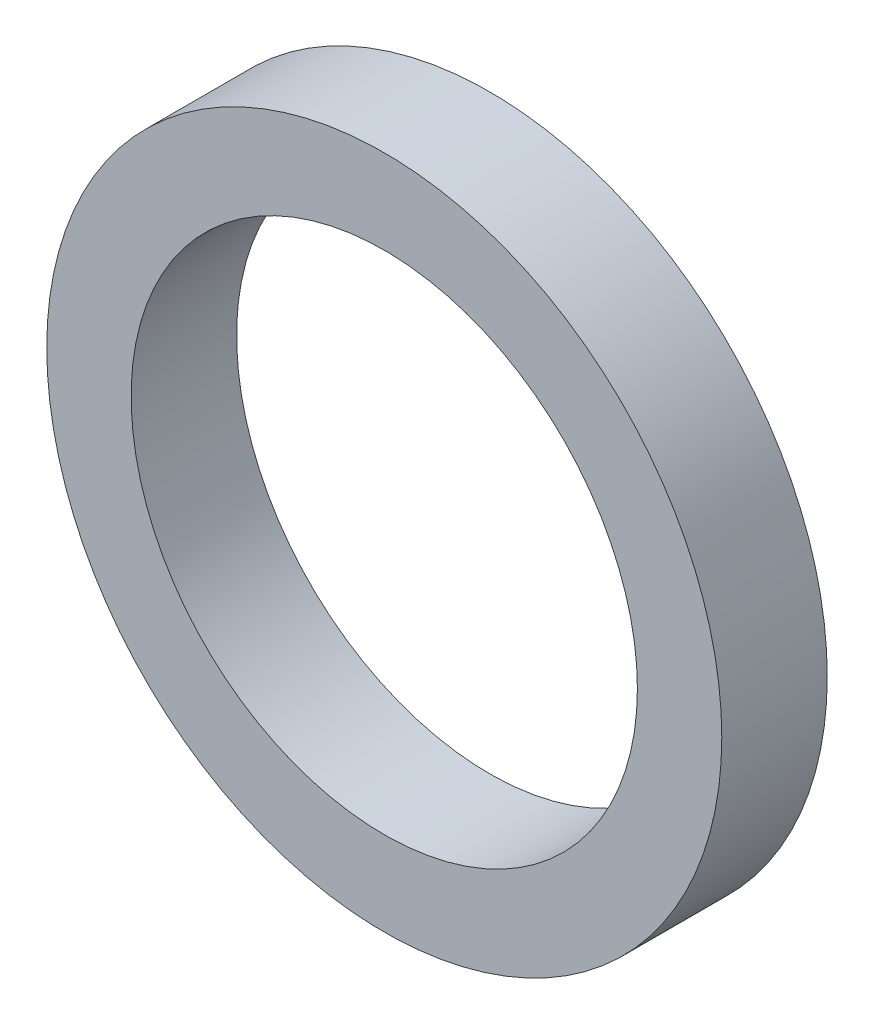
ISO-10303-21;
HEADER;
FILE_DESCRIPTION(('STEP AP214'),'2;1');
FILE_NAME('part.step','',(''),(''),'','','');
FILE_SCHEMA(('AUTOMOTIVE_DESIGN { 1 0 10303 214 1 1 1 1 }'));
ENDSEC;
DATA;
#1=APPLICATION_CONTEXT('core data for automotive mechanical design processes');
#2=APPLICATION_PROTOCOL_DEFINITION('international standard','automotive_design',2000,#1);
#3=PRODUCT_CONTEXT('',#1,'mechanical');
#4=PRODUCT('Part','Part','',(#3));
#5=PRODUCT_RELATED_PRODUCT_CATEGORY('part','',(#4));
#6=PRODUCT_DEFINITION_FORMATION('','',#4);
#7=PRODUCT_DEFINITION_CONTEXT('part definition',#1,'design');
#8=PRODUCT_DEFINITION('design','',#6,#7);
#9=PRODUCT_DEFINITION_SHAPE('','',#8);
#10=(LENGTH_UNIT() NAMED_UNIT(*) SI_UNIT(.MILLI.,.METRE.));
#11=(NAMED_UNIT(*) PLANE_ANGLE_UNIT() SI_UNIT($,.RADIAN.));
#12=(NAMED_UNIT(*) SI_UNIT($,.STERADIAN.) SOLID_ANGLE_UNIT());
#13=UNCERTAINTY_MEASURE_WITH_UNIT(LENGTH_MEASURE(1.E-05),#10,'distance_accuracy_value','');
#14=(GEOMETRIC_REPRESENTATION_CONTEXT(3) GLOBAL_UNCERTAINTY_ASSIGNED_CONTEXT((#13)) GLOBAL_UNIT_ASSIGNED_CONTEXT((#10,
#11,#12)) REPRESENTATION_CONTEXT('',''));
#15=CARTESIAN_POINT('',(0.,0.,0.));
#16=DIRECTION('',(0.,0.,1.));
#17=DIRECTION('',(1.,0.,0.));
#18=AXIS2_PLACEMENT_3D('',#15,#16,#17);
#19=CARTESIAN_POINT('',(0.,0.,2.5));
#20=DIRECTION('',(0.,0.,1.));
#21=DIRECTION('',(1.,0.,0.));
#22=AXIS2_PLACEMENT_3D('',#19,#20,#21);
#23=PLANE('',#22);
#24=CARTESIAN_POINT('',(0.,0.,2.5));
#25=DIRECTION('',(0.,0.,1.));
#26=DIRECTION('',(1.,0.,0.));
#27=AXIS2_PLACEMENT_3D('',#24,#25,#26);
#28=CIRCLE('',#27,8.);
#29=CARTESIAN_POINT('',(8.,0.,2.5));
#30=VERTEX_POINT('',#29);
#31=EDGE_CURVE('E10',#30,#30,#28,.T.);
#32=ORIENTED_EDGE('',*,*,#31,.T.);
#33=EDGE_LOOP('',(#32));
#34=FACE_BOUND('',#33,.T.);
#35=CARTESIAN_POINT('',(0.,0.,2.5));
#36=DIRECTION('',(0.,0.,1.));
#37=DIRECTION('',(1.,0.,0.));
#38=AXIS2_PLACEMENT_3D('',#35,#36,#37);
#39=CIRCLE('',#38,6.);
#40=CARTESIAN_POINT('',(6.,0.,2.5));
#41=VERTEX_POINT('',#40);
#42=EDGE_CURVE('E41',#41,#41,#39,.T.);
#43=ORIENTED_EDGE('',*,*,#42,.F.);
#44=EDGE_LOOP('',(#43));
#45=FACE_BOUND('',#44,.T.);
#46=ADVANCED_FACE('F30',(#34,#45),#23,.T.);
#47=CARTESIAN_POINT('',(0.,0.,0.));
#48=DIRECTION('',(0.,0.,1.));
#49=DIRECTION('',(1.,0.,0.));
#50=AXIS2_PLACEMENT_3D('',#47,#48,#49);
#51=PLANE('',#50);
#52=CARTESIAN_POINT('',(0.,0.,0.));
#53=DIRECTION('',(0.,0.,1.));
#54=DIRECTION('',(1.,0.,0.));
#55=AXIS2_PLACEMENT_3D('',#52,#53,#54);
#56=CIRCLE('',#55,8.);
#57=CARTESIAN_POINT('',(8.,0.,0.));
#58=VERTEX_POINT('',#57);
#59=EDGE_CURVE('E34',#58,#58,#56,.T.);
#60=ORIENTED_EDGE('',*,*,#59,.F.);
#61=EDGE_LOOP('',(#60));
#62=FACE_BOUND('',#61,.T.);
#63=CARTESIAN_POINT('',(0.,0.,0.));
#64=DIRECTION('',(0.,0.,1.));
#65=DIRECTION('',(1.,0.,0.));
#66=AXIS2_PLACEMENT_3D('',#63,#64,#65);
#67=CIRCLE('',#66,6.);
#68=CARTESIAN_POINT('',(6.,0.,0.));
#69=VERTEX_POINT('',#68);
#70=EDGE_CURVE('E43',#69,#69,#67,.T.);
#71=ORIENTED_EDGE('',*,*,#70,.T.);
#72=EDGE_LOOP('',(#71));
#73=FACE_BOUND('',#72,.T.);
#74=ADVANCED_FACE('F53',(#62,#73),#51,.F.);
#75=CARTESIAN_POINT('',(0.,0.,2.5));
#76=DIRECTION('',(0.,0.,-1.));
#77=DIRECTION('',(-1.,0.,0.));
#78=AXIS2_PLACEMENT_3D('',#75,#76,#77);
#79=CYLINDRICAL_SURFACE('',#78,8.);
#80=ORIENTED_EDGE('',*,*,#31,.F.);
#81=EDGE_LOOP('',(#80));
#82=FACE_BOUND('',#81,.T.);
#83=ORIENTED_EDGE('',*,*,#59,.T.);
#84=EDGE_LOOP('',(#83));
#85=FACE_BOUND('',#84,.T.);
#86=ADVANCED_FACE('F32',(#82,#85),#79,.T.);
#87=CARTESIAN_POINT('',(0.,0.,2.5));
#88=DIRECTION('',(0.,0.,-1.));
#89=DIRECTION('',(-1.,0.,0.));
#90=AXIS2_PLACEMENT_3D('',#87,#88,#89);
#91=CYLINDRICAL_SURFACE('',#90,6.);
#92=ORIENTED_EDGE('',*,*,#42,.T.);
#93=EDGE_LOOP('',(#92));
#94=FACE_BOUND('',#93,.T.);
#95=ORIENTED_EDGE('',*,*,#70,.F.);
#96=EDGE_LOOP('',(#95));
#97=FACE_BOUND('',#96,.T.);
#98=ADVANCED_FACE('F49',(#94,#97),#91,.F.);
#99=CLOSED_SHELL('',(#46,#74,#86,#98));
#100=MANIFOLD_SOLID_BREP('B2',#99);
#101=ADVANCED_BREP_SHAPE_REPRESENTATION('',(#18,#100),#14);
#102=SHAPE_DEFINITION_REPRESENTATION(#9,#101);
ENDSEC;
END-ISO-10303-21;
